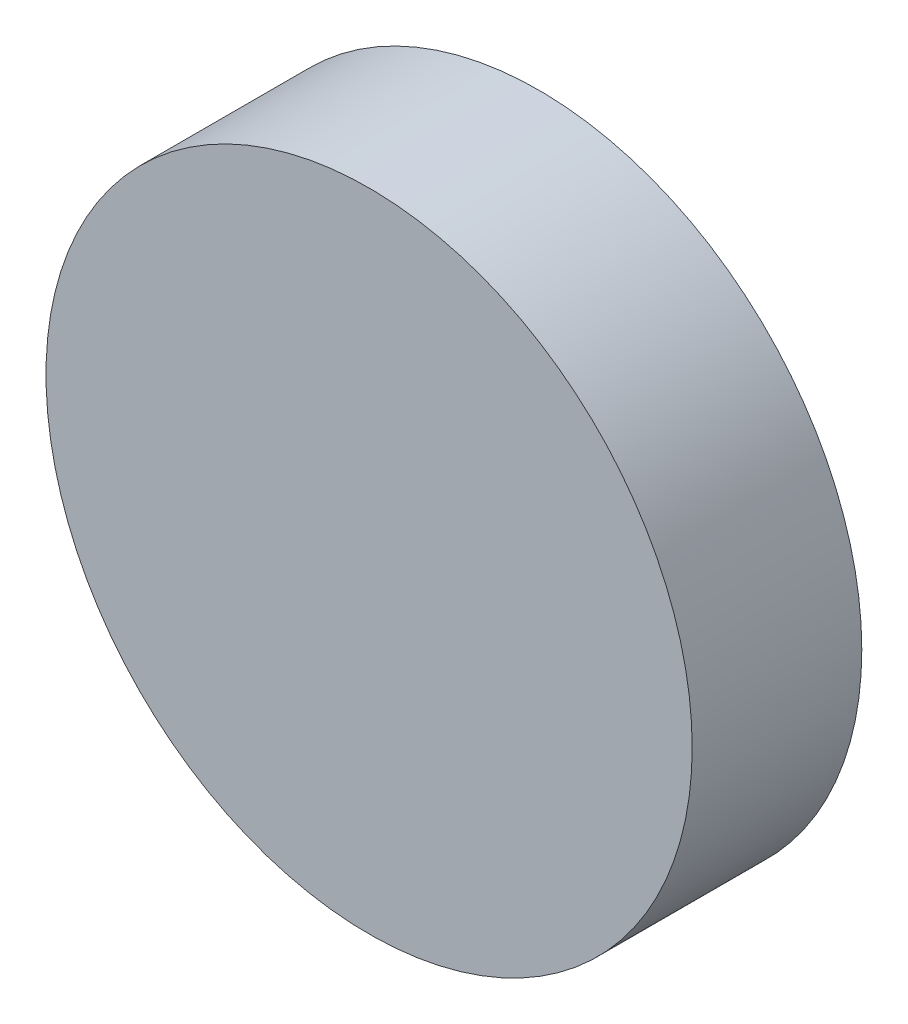
ISO-10303-21;
HEADER;
FILE_DESCRIPTION(('STEP AP214'),'2;1');
FILE_NAME('part.step','',(''),(''),'','','');
FILE_SCHEMA(('AUTOMOTIVE_DESIGN { 1 0 10303 214 1 1 1 1 }'));
ENDSEC;
DATA;
#1=APPLICATION_CONTEXT('core data for automotive mechanical design processes');
#2=APPLICATION_PROTOCOL_DEFINITION('international standard','automotive_design',2000,#1);
#3=PRODUCT_CONTEXT('',#1,'mechanical');
#4=PRODUCT('Part','Part','',(#3));
#5=PRODUCT_RELATED_PRODUCT_CATEGORY('part','',(#4));
#6=PRODUCT_DEFINITION_FORMATION('','',#4);
#7=PRODUCT_DEFINITION_CONTEXT('part definition',#1,'design');
#8=PRODUCT_DEFINITION('design','',#6,#7);
#9=PRODUCT_DEFINITION_SHAPE('','',#8);
#10=(LENGTH_UNIT() NAMED_UNIT(*) SI_UNIT(.MILLI.,.METRE.));
#11=(NAMED_UNIT(*) PLANE_ANGLE_UNIT() SI_UNIT($,.RADIAN.));
#12=(NAMED_UNIT(*) SI_UNIT($,.STERADIAN.) SOLID_ANGLE_UNIT());
#13=UNCERTAINTY_MEASURE_WITH_UNIT(LENGTH_MEASURE(1.E-05),#10,'distance_accuracy_value','');
#14=(GEOMETRIC_REPRESENTATION_CONTEXT(3) GLOBAL_UNCERTAINTY_ASSIGNED_CONTEXT((#13)) GLOBAL_UNIT_ASSIGNED_CONTEXT((#10,
#11,#12)) REPRESENTATION_CONTEXT('',''));
#15=CARTESIAN_POINT('',(0.,0.,0.));
#16=DIRECTION('',(0.,0.,1.));
#17=DIRECTION('',(1.,0.,0.));
#18=AXIS2_PLACEMENT_3D('',#15,#16,#17);
#19=CARTESIAN_POINT('',(0.,0.,10.));
#20=DIRECTION('',(0.,0.,-1.));
#21=DIRECTION('',(-1.,0.,0.));
#22=AXIS2_PLACEMENT_3D('',#19,#20,#21);
#23=CYLINDRICAL_SURFACE('',#22,19.05);
#24=CARTESIAN_POINT('',(0.,0.,10.));
#25=DIRECTION('',(0.,0.,1.));
#26=DIRECTION('',(1.,0.,0.));
#27=AXIS2_PLACEMENT_3D('',#24,#25,#26);
#28=CIRCLE('',#27,19.05);
#29=CARTESIAN_POINT('',(19.05,0.,10.));
#30=VERTEX_POINT('',#29);
#31=EDGE_CURVE('E10',#30,#30,#28,.T.);
#32=ORIENTED_EDGE('',*,*,#31,.F.);
#33=EDGE_LOOP('',(#32));
#34=FACE_BOUND('',#33,.T.);
#35=CARTESIAN_POINT('',(0.,0.,0.));
#36=DIRECTION('',(0.,0.,1.));
#37=DIRECTION('',(1.,0.,0.));
#38=AXIS2_PLACEMENT_3D('',#35,#36,#37);
#39=CIRCLE('',#38,19.05);
#40=CARTESIAN_POINT('',(19.05,0.,0.));
#41=VERTEX_POINT('',#40);
#42=EDGE_CURVE('E42',#41,#41,#39,.T.);
#43=ORIENTED_EDGE('',*,*,#42,.T.);
#44=EDGE_LOOP('',(#43));
#45=FACE_BOUND('',#44,.T.);
#46=ADVANCED_FACE('F39',(#34,#45),#23,.T.);
#47=CARTESIAN_POINT('',(0.,0.,10.));
#48=DIRECTION('',(0.,0.,1.));
#49=DIRECTION('',(1.,0.,0.));
#50=AXIS2_PLACEMENT_3D('',#47,#48,#49);
#51=PLANE('',#50);
#52=ORIENTED_EDGE('',*,*,#31,.T.);
#53=EDGE_LOOP('',(#52));
#54=FACE_BOUND('',#53,.T.);
#55=ADVANCED_FACE('F56',(#54),#51,.T.);
#56=CARTESIAN_POINT('',(0.,0.,0.));
#57=DIRECTION('',(0.,0.,1.));
#58=DIRECTION('',(1.,0.,0.));
#59=AXIS2_PLACEMENT_3D('',#56,#57,#58);
#60=PLANE('',#59);
#61=ORIENTED_EDGE('',*,*,#42,.F.);
#62=EDGE_LOOP('',(#61));
#63=FACE_BOUND('',#62,.T.);
#64=ADVANCED_FACE('F54',(#63),#60,.F.);
#65=CLOSED_SHELL('',(#46,#55,#64));
#66=MANIFOLD_SOLID_BREP('B2',#65);
#67=ADVANCED_BREP_SHAPE_REPRESENTATION('',(#18,#66),#14);
#68=SHAPE_DEFINITION_REPRESENTATION(#9,#67);
ENDSEC;
END-ISO-10303-21;
